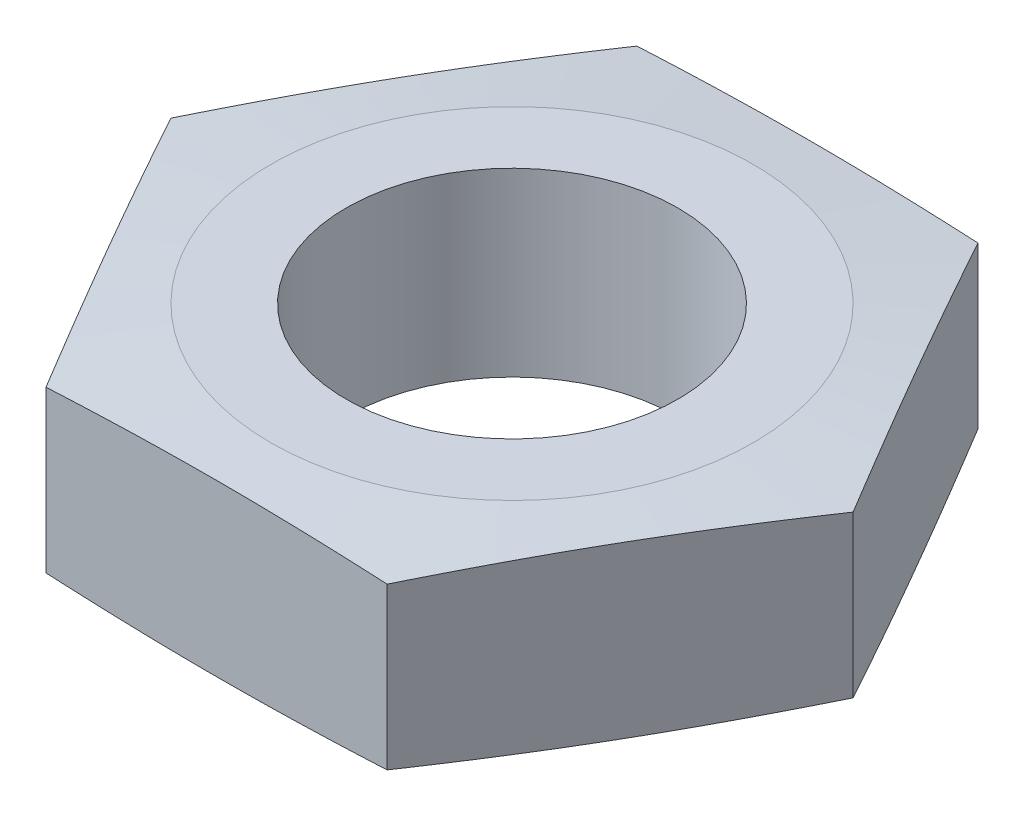
ISO-10303-21;
HEADER;
FILE_DESCRIPTION(('STEP AP214'),'2;1');
FILE_NAME('part.step','',(''),(''),'','','');
FILE_SCHEMA(('AUTOMOTIVE_DESIGN { 1 0 10303 214 1 1 1 1 }'));
ENDSEC;
DATA;
#1=APPLICATION_CONTEXT('core data for automotive mechanical design processes');
#2=APPLICATION_PROTOCOL_DEFINITION('international standard','automotive_design',2000,#1);
#3=PRODUCT_CONTEXT('',#1,'mechanical');
#4=PRODUCT('Part','Part','',(#3));
#5=PRODUCT_RELATED_PRODUCT_CATEGORY('part','',(#4));
#6=PRODUCT_DEFINITION_FORMATION('','',#4);
#7=PRODUCT_DEFINITION_CONTEXT('part definition',#1,'design');
#8=PRODUCT_DEFINITION('design','',#6,#7);
#9=PRODUCT_DEFINITION_SHAPE('','',#8);
#10=(LENGTH_UNIT() NAMED_UNIT(*) SI_UNIT(.MILLI.,.METRE.));
#11=(NAMED_UNIT(*) PLANE_ANGLE_UNIT() SI_UNIT($,.RADIAN.));
#12=(NAMED_UNIT(*) SI_UNIT($,.STERADIAN.) SOLID_ANGLE_UNIT());
#13=UNCERTAINTY_MEASURE_WITH_UNIT(LENGTH_MEASURE(1.E-05),#10,'distance_accuracy_value','');
#14=(GEOMETRIC_REPRESENTATION_CONTEXT(3) GLOBAL_UNCERTAINTY_ASSIGNED_CONTEXT((#13)) GLOBAL_UNIT_ASSIGNED_CONTEXT((#10,
#11,#12)) REPRESENTATION_CONTEXT('',''));
#15=CARTESIAN_POINT('',(0.,0.,0.));
#16=DIRECTION('',(0.,0.,1.));
#17=DIRECTION('',(1.,0.,0.));
#18=AXIS2_PLACEMENT_3D('',#15,#16,#17);
#19=CARTESIAN_POINT('',(-2.82901631902917,1.5,4.9));
#20=DIRECTION('',(0.,0.,-1.));
#21=DIRECTION('',(-1.,0.,0.));
#22=AXIS2_PLACEMENT_3D('',#19,#20,#21);
#23=PLANE('',#22);
#24=CARTESIAN_POINT('',(-7.47109907735667,-1.00653863304741,4.9));
#25=CARTESIAN_POINT('',(-7.24856236014099,-1.02514412298883,4.9));
#26=CARTESIAN_POINT('',(-7.02600547216599,-1.04350771336726,4.9));
#27=CARTESIAN_POINT('',(-6.58084135956366,-1.0796312885138,4.9));
#28=CARTESIAN_POINT('',(-6.35823413462823,-1.09739126948086,4.9));
#29=CARTESIAN_POINT('',(-5.69026658544264,-1.14959039421229,4.9));
#30=CARTESIAN_POINT('',(-5.24481993569117,-1.18294367654422,4.9));
#31=CARTESIAN_POINT('',(-4.35409507703629,-1.24527219436755,4.9));
#32=CARTESIAN_POINT('',(-3.90881719743005,-1.27425207364141,4.9));
#33=CARTESIAN_POINT('',(-3.01787712788772,-1.32566836961985,4.9));
#34=CARTESIAN_POINT('',(-2.5722149480883,-1.34810495392267,4.9));
#35=CARTESIAN_POINT('',(-1.90310838277142,-1.37473844982548,4.9));
#36=CARTESIAN_POINT('',(-1.67980405540288,-1.38244917287994,4.9));
#37=CARTESIAN_POINT('',(-1.23311960808795,-1.39517553267675,4.9));
#38=CARTESIAN_POINT('',(-1.00973948903471,-1.40019120014511,4.9));
#39=CARTESIAN_POINT('',(-0.562943374380458,-1.40726997751627,4.9));
#40=CARTESIAN_POINT('',(-0.339527381266118,-1.40933324179001,4.9));
#41=CARTESIAN_POINT('',(0.107311956766196,-1.41039167435151,4.9));
#42=CARTESIAN_POINT('',(0.330735301682421,-1.40938684336388,4.9));
#43=CARTESIAN_POINT('',(0.777659835380096,-1.40436501603405,4.9));
#44=CARTESIAN_POINT('',(1.00116100688973,-1.40034650689583,4.9));
#45=CARTESIAN_POINT('',(1.44809643611479,-1.38951062191602,4.9));
#46=CARTESIAN_POINT('',(1.67153069306241,-1.38269321510401,4.9));
#47=CARTESIAN_POINT('',(2.34172762215674,-1.35852085026062,4.9));
#48=CARTESIAN_POINT('',(2.78835626533211,-1.33744613842943,4.9));
#49=CARTESIAN_POINT('',(3.66354970944947,-1.28923839010267,4.9));
#50=CARTESIAN_POINT('',(4.09213031646093,-1.26237792602413,4.9));
#51=CARTESIAN_POINT('',(4.94899907590043,-1.20427282978973,4.9));
#52=CARTESIAN_POINT('',(5.37728722203045,-1.17302810603745,4.9));
#53=CARTESIAN_POINT('',(6.23365739957386,-1.10758374437045,4.9));
#54=CARTESIAN_POINT('',(6.6617394188844,-1.07338395021818,4.9));
#55=CARTESIAN_POINT('',(7.51773771687456,-1.00296419443362,4.9));
#56=CARTESIAN_POINT('',(7.94565399497719,-0.96674422583106,4.9));
#57=CARTESIAN_POINT('',(8.80076818602211,-0.892939677446466,4.9));
#58=CARTESIAN_POINT('',(9.22796626975954,-0.855357067420007,4.9));
#59=CARTESIAN_POINT('',(10.0822727519871,-0.779174551195442,4.9));
#60=CARTESIAN_POINT('',(10.5093811502087,-0.740574641995029,4.9));
#61=CARTESIAN_POINT('',(11.3634348139587,-0.662635675856532,4.9));
#62=CARTESIAN_POINT('',(11.7903800946575,-0.623296784778671,4.9));
#63=CARTESIAN_POINT('',(12.6442150050174,-0.544044031663291,4.9));
#64=CARTESIAN_POINT('',(13.0711046349661,-0.504130172726609,4.9));
#65=CARTESIAN_POINT('',(13.4979750990547,-0.464014861585602,4.9));
#66=B_SPLINE_CURVE_WITH_KNOTS('',3,(#24,#25,#26,#27,#28,#29,#30,#31,#32,#33,#34,#35,#36,#37,#38,
#39,#40,#41,#42,#43,#44,#45,#46,#47,#48,#49,#50,#51,#52,#53,#54,#55,#56,#57,#58,#59,#60,#61,#62,
#63,#64,#65),.UNSPECIFIED.,.F.,.F.,(4,2,2,2,2,2,2,2,2,2,2,2,2,2,2,2,2,2,2,2,4),(0.,
0.669938984867388,1.33988218769278,2.67994787700641,4.01858048683973,5.35717880627859,
6.02747745062249,6.69776845281103,7.36802440652299,8.0382802019385,8.70887267549961,
9.37947256951599,10.7207569059899,12.0089933497948,13.2972567115822,14.5855882268773,
15.8739241876202,17.1604667542172,18.4470131181527,19.7332740949343,21.0195281374242),.UNSPECIFIED.);
#67=CARTESIAN_POINT('',(2.82901631902916,-1.33419673619417,4.9));
#68=VERTEX_POINT('',#67);
#69=CARTESIAN_POINT('',(-2.82901631902917,-1.33419673619417,4.9));
#70=VERTEX_POINT('',#69);
#71=EDGE_CURVE('E62',#68,#70,#66,.F.);
#72=ORIENTED_EDGE('',*,*,#71,.F.);
#73=DIRECTION('',(0.,-1.,0.));
#74=VECTOR('',#73,1.);
#75=CARTESIAN_POINT('',(2.82901631902916,1.5,4.9));
#76=LINE('',#75,#74);
#77=CARTESIAN_POINT('',(2.82901631902916,1.33419673619417,4.9));
#78=VERTEX_POINT('',#77);
#79=EDGE_CURVE('E55',#78,#68,#76,.T.);
#80=ORIENTED_EDGE('',*,*,#79,.F.);
#81=CARTESIAN_POINT('',(-7.47109907735667,1.00653863304741,4.9));
#82=CARTESIAN_POINT('',(-7.24856236014099,1.02514412298883,4.9));
#83=CARTESIAN_POINT('',(-7.02600547216599,1.04350771336726,4.9));
#84=CARTESIAN_POINT('',(-6.58084135956366,1.0796312885138,4.9));
#85=CARTESIAN_POINT('',(-6.35823413462823,1.09739126948086,4.9));
#86=CARTESIAN_POINT('',(-5.69026658544264,1.14959039421229,4.9));
#87=CARTESIAN_POINT('',(-5.24481993569117,1.18294367654422,4.9));
#88=CARTESIAN_POINT('',(-4.35409507703629,1.24527219436755,4.9));
#89=CARTESIAN_POINT('',(-3.90881719743005,1.27425207364141,4.9));
#90=CARTESIAN_POINT('',(-3.01787712788772,1.32566836961985,4.9));
#91=CARTESIAN_POINT('',(-2.5722149480883,1.34810495392267,4.9));
#92=CARTESIAN_POINT('',(-1.90310838277142,1.37473844982548,4.9));
#93=CARTESIAN_POINT('',(-1.67980405540288,1.38244917287994,4.9));
#94=CARTESIAN_POINT('',(-1.23311960808795,1.39517553267675,4.9));
#95=CARTESIAN_POINT('',(-1.00973948903471,1.40019120014511,4.9));
#96=CARTESIAN_POINT('',(-0.562943374380458,1.40726997751627,4.9));
#97=CARTESIAN_POINT('',(-0.339527381266118,1.40933324179001,4.9));
#98=CARTESIAN_POINT('',(0.107311956766196,1.41039167435151,4.9));
#99=CARTESIAN_POINT('',(0.330735301682421,1.40938684336388,4.9));
#100=CARTESIAN_POINT('',(0.777659835380096,1.40436501603405,4.9));
#101=CARTESIAN_POINT('',(1.00116100688973,1.40034650689583,4.9));
#102=CARTESIAN_POINT('',(1.44809643611479,1.38951062191602,4.9));
#103=CARTESIAN_POINT('',(1.67153069306241,1.38269321510401,4.9));
#104=CARTESIAN_POINT('',(2.34172762215674,1.35852085026062,4.9));
#105=CARTESIAN_POINT('',(2.78835626533211,1.33744613842943,4.9));
#106=CARTESIAN_POINT('',(3.66354970944947,1.28923839010267,4.9));
#107=CARTESIAN_POINT('',(4.09213031646093,1.26237792602413,4.9));
#108=CARTESIAN_POINT('',(4.94899907590043,1.20427282978973,4.9));
#109=CARTESIAN_POINT('',(5.37728722203045,1.17302810603745,4.9));
#110=CARTESIAN_POINT('',(6.23365739957386,1.10758374437045,4.9));
#111=CARTESIAN_POINT('',(6.6617394188844,1.07338395021818,4.9));
#112=CARTESIAN_POINT('',(7.51773771687456,1.00296419443362,4.9));
#113=CARTESIAN_POINT('',(7.94565399497719,0.96674422583106,4.9));
#114=CARTESIAN_POINT('',(8.80076818602211,0.892939677446466,4.9));
#115=CARTESIAN_POINT('',(9.22796626975954,0.855357067420007,4.9));
#116=CARTESIAN_POINT('',(10.0822727519871,0.779174551195442,4.9));
#117=CARTESIAN_POINT('',(10.5093811502087,0.740574641995029,4.9));
#118=CARTESIAN_POINT('',(11.3634348139587,0.662635675856532,4.9));
#119=CARTESIAN_POINT('',(11.7903800946575,0.623296784778671,4.9));
#120=CARTESIAN_POINT('',(12.6442150050174,0.544044031663291,4.9));
#121=CARTESIAN_POINT('',(13.0711046349661,0.504130172726609,4.9));
#122=CARTESIAN_POINT('',(13.4979750990547,0.464014861585602,4.9));
#123=B_SPLINE_CURVE_WITH_KNOTS('',3,(#81,#82,#83,#84,#85,#86,#87,#88,#89,#90,#91,#92,#93,#94,
#95,#96,#97,#98,#99,#100,#101,#102,#103,#104,#105,#106,#107,#108,#109,#110,#111,#112,#113,#114,
#115,#116,#117,#118,#119,#120,#121,#122),.UNSPECIFIED.,.F.,.F.,(4,2,2,2,2,2,2,2,2,2,2,2,2,2,2,2,
2,2,2,2,4),(0.,0.669938984867388,1.33988218769278,2.67994787700641,4.01858048683973,
5.35717880627859,6.02747745062249,6.69776845281103,7.36802440652299,8.0382802019385,
8.70887267549961,9.37947256951599,10.7207569059899,12.0089933497948,13.2972567115822,
14.5855882268773,15.8739241876202,17.1604667542172,18.4470131181527,19.7332740949343,
21.0195281374242),.UNSPECIFIED.);
#124=CARTESIAN_POINT('',(-2.82901631902917,1.33419673619417,4.9));
#125=VERTEX_POINT('',#124);
#126=EDGE_CURVE('E127',#125,#78,#123,.T.);
#127=ORIENTED_EDGE('',*,*,#126,.F.);
#128=DIRECTION('',(0.,-1.,0.));
#129=VECTOR('',#128,1.);
#130=CARTESIAN_POINT('',(-2.82901631902917,1.5,4.9));
#131=LINE('',#130,#129);
#132=EDGE_CURVE('E120',#125,#70,#131,.T.);
#133=ORIENTED_EDGE('',*,*,#132,.T.);
#134=EDGE_LOOP('',(#72,#80,#127,#133));
#135=FACE_BOUND('',#134,.T.);
#136=ADVANCED_FACE('F39',(#135),#23,.F.);
#137=CARTESIAN_POINT('',(2.82901631902916,1.5,4.9));
#138=DIRECTION('',(-0.866025403784439,0.,-0.5));
#139=DIRECTION('',(-0.5,0.,0.866025403784439));
#140=AXIS2_PLACEMENT_3D('',#137,#138,#139);
#141=PLANE('',#140);
#142=CARTESIAN_POINT('',(5.65814810811217,-1.33418518883531,-0.000199999999996242));
#143=CARTESIAN_POINT('',(5.54031817177861,-1.3459738480169,0.203887436382334));
#144=CARTESIAN_POINT('',(5.42245803825476,-1.35665356088679,0.408027175832484));
#145=CARTESIAN_POINT('',(5.18667966555825,-1.37539024798846,0.816407296668759));
#146=CARTESIAN_POINT('',(5.06876142359181,-1.38344708057591,1.02064768289384));
#147=CARTESIAN_POINT('',(4.83296724142084,-1.39652706360113,1.4290551865431));
#148=CARTESIAN_POINT('',(4.71509133240421,-1.40155240630638,1.63322224994827));
#149=CARTESIAN_POINT('',(4.479318441363,-1.40828883219344,2.04159287627904));
#150=CARTESIAN_POINT('',(4.36142145995338,-1.41,2.24579643813952));
#151=CARTESIAN_POINT('',(4.12562749713412,-1.41,2.65420356186048));
#152=CARTESIAN_POINT('',(4.00773051572449,-1.40828883219344,2.85840712372096));
#153=CARTESIAN_POINT('',(3.77195762468328,-1.40155240630638,3.26677775005173));
#154=CARTESIAN_POINT('',(3.65408171566665,-1.39652706360113,3.4709448134569));
#155=CARTESIAN_POINT('',(3.41828753349569,-1.38344708057591,3.87935231710616));
#156=CARTESIAN_POINT('',(3.30036929152925,-1.37539024798846,4.08359270333124));
#157=CARTESIAN_POINT('',(3.06459091883273,-1.35665356088679,4.49197282416752));
#158=CARTESIAN_POINT('',(2.94673078530889,-1.3459738480169,4.69611256361767));
#159=CARTESIAN_POINT('',(2.82890084897533,-1.33418518883531,4.9002));
#160=B_SPLINE_CURVE_WITH_KNOTS('',3,(#142,#143,#144,#145,#146,#147,#148,#149,#150,#151,#152,
#153,#154,#155,#156,#157,#158,#159),.UNSPECIFIED.,.F.,.F.,(4,2,2,2,2,2,2,2,4),(0.,
0.707868433880265,1.41577508869476,2.12316919454419,2.83054523742568,3.53792128030717,
4.2453153861566,4.9532220409711,5.66109047485136),.UNSPECIFIED.);
#161=CARTESIAN_POINT('',(5.65803263805833,-1.33419673619417,0.));
#162=VERTEX_POINT('',#161);
#163=EDGE_CURVE('E146',#162,#68,#160,.T.);
#164=ORIENTED_EDGE('',*,*,#163,.F.);
#165=DIRECTION('',(0.,-1.,0.));
#166=VECTOR('',#165,1.);
#167=CARTESIAN_POINT('',(5.65803263805833,1.5,0.));
#168=LINE('',#167,#166);
#169=CARTESIAN_POINT('',(5.65803263805833,1.33419673619417,0.));
#170=VERTEX_POINT('',#169);
#171=EDGE_CURVE('E134',#170,#162,#168,.T.);
#172=ORIENTED_EDGE('',*,*,#171,.F.);
#173=CARTESIAN_POINT('',(2.82890084897533,1.33418518883531,4.9002));
#174=CARTESIAN_POINT('',(2.94673078530889,1.3459738480169,4.69611256361767));
#175=CARTESIAN_POINT('',(3.06459091883273,1.35665356088679,4.49197282416752));
#176=CARTESIAN_POINT('',(3.30036929152925,1.37539024798846,4.08359270333124));
#177=CARTESIAN_POINT('',(3.41828753349569,1.38344708057591,3.87935231710616));
#178=CARTESIAN_POINT('',(3.65408171566665,1.39652706360113,3.4709448134569));
#179=CARTESIAN_POINT('',(3.77195762468328,1.40155240630638,3.26677775005173));
#180=CARTESIAN_POINT('',(4.00773051572449,1.40828883219344,2.85840712372096));
#181=CARTESIAN_POINT('',(4.12562749713412,1.41,2.65420356186048));
#182=CARTESIAN_POINT('',(4.36142145995338,1.41,2.24579643813952));
#183=CARTESIAN_POINT('',(4.47931844136301,1.40828883219344,2.04159287627904));
#184=CARTESIAN_POINT('',(4.71509133240421,1.40155240630638,1.63322224994827));
#185=CARTESIAN_POINT('',(4.83296724142084,1.39652706360113,1.4290551865431));
#186=CARTESIAN_POINT('',(5.06876142359181,1.38344708057591,1.02064768289384));
#187=CARTESIAN_POINT('',(5.18667966555825,1.37539024798846,0.816407296668758));
#188=CARTESIAN_POINT('',(5.42245803825476,1.35665356088679,0.408027175832483));
#189=CARTESIAN_POINT('',(5.54031817177861,1.3459738480169,0.203887436382333));
#190=CARTESIAN_POINT('',(5.65814810811217,1.33418518883531,-0.000199999999997153));
#191=B_SPLINE_CURVE_WITH_KNOTS('',3,(#173,#174,#175,#176,#177,#178,#179,#180,#181,#182,#183,
#184,#185,#186,#187,#188,#189,#190),.UNSPECIFIED.,.F.,.F.,(4,2,2,2,2,2,2,2,4),(0.,
0.707868433880266,1.41577508869476,2.12316919454419,2.83054523742568,3.53792128030717,
4.2453153861566,4.9532220409711,5.66109047485136),.UNSPECIFIED.);
#192=EDGE_CURVE('E147',#78,#170,#191,.T.);
#193=ORIENTED_EDGE('',*,*,#192,.F.);
#194=ORIENTED_EDGE('',*,*,#79,.T.);
#195=EDGE_LOOP('',(#164,#172,#193,#194));
#196=FACE_BOUND('',#195,.T.);
#197=ADVANCED_FACE('F144',(#196),#141,.F.);
#198=CARTESIAN_POINT('',(5.65803263805833,1.5,0.));
#199=DIRECTION('',(-0.866025403784439,0.,0.5));
#200=DIRECTION('',(0.5,0.,0.866025403784439));
#201=AXIS2_PLACEMENT_3D('',#198,#199,#200);
#202=PLANE('',#201);
#203=CARTESIAN_POINT('',(2.82890084897533,-1.33418518883531,-4.9002));
#204=CARTESIAN_POINT('',(2.94673078530889,-1.3459738480169,-4.69611256361767));
#205=CARTESIAN_POINT('',(3.06459091883273,-1.35665356088679,-4.49197282416752));
#206=CARTESIAN_POINT('',(3.30036929152925,-1.37539024798846,-4.08359270333124));
#207=CARTESIAN_POINT('',(3.41828753349569,-1.38344708057591,-3.87935231710616));
#208=CARTESIAN_POINT('',(3.65408171566665,-1.39652706360113,-3.4709448134569));
#209=CARTESIAN_POINT('',(3.77195762468328,-1.40155240630638,-3.26677775005173));
#210=CARTESIAN_POINT('',(4.00773051572449,-1.40828883219344,-2.85840712372096));
#211=CARTESIAN_POINT('',(4.12562749713412,-1.41,-2.65420356186048));
#212=CARTESIAN_POINT('',(4.36142145995338,-1.41,-2.24579643813952));
#213=CARTESIAN_POINT('',(4.47931844136301,-1.40828883219344,-2.04159287627904));
#214=CARTESIAN_POINT('',(4.71509133240421,-1.40155240630638,-1.63322224994827));
#215=CARTESIAN_POINT('',(4.83296724142084,-1.39652706360113,-1.42905518654309));
#216=CARTESIAN_POINT('',(5.06876142359181,-1.38344708057591,-1.02064768289383));
#217=CARTESIAN_POINT('',(5.18667966555825,-1.37539024798846,-0.816407296668754));
#218=CARTESIAN_POINT('',(5.42245803825476,-1.35665356088679,-0.408027175832479));
#219=CARTESIAN_POINT('',(5.54031817177861,-1.3459738480169,-0.203887436382328));
#220=CARTESIAN_POINT('',(5.65814810811217,-1.33418518883531,0.000200000000003215));
#221=B_SPLINE_CURVE_WITH_KNOTS('',3,(#203,#204,#205,#206,#207,#208,#209,#210,#211,#212,#213,
#214,#215,#216,#217,#218,#219,#220),.UNSPECIFIED.,.F.,.F.,(4,2,2,2,2,2,2,2,4),(0.,
0.707868433880266,1.41577508869476,2.12316919454419,2.83054523742568,3.53792128030718,
4.24531538615661,4.9532220409711,5.66109047485137),.UNSPECIFIED.);
#222=CARTESIAN_POINT('',(2.82901631902916,-1.33419673619417,-4.9));
#223=VERTEX_POINT('',#222);
#224=EDGE_CURVE('E158',#223,#162,#221,.T.);
#225=ORIENTED_EDGE('',*,*,#224,.F.);
#226=DIRECTION('',(0.,-1.,0.));
#227=VECTOR('',#226,1.);
#228=CARTESIAN_POINT('',(2.82901631902916,1.5,-4.9));
#229=LINE('',#228,#227);
#230=CARTESIAN_POINT('',(2.82901631902916,1.33419673619417,-4.9));
#231=VERTEX_POINT('',#230);
#232=EDGE_CURVE('E125',#231,#223,#229,.T.);
#233=ORIENTED_EDGE('',*,*,#232,.F.);
#234=CARTESIAN_POINT('',(5.65814810811217,1.33418518883531,0.000200000000003808));
#235=CARTESIAN_POINT('',(5.54031817177861,1.3459738480169,-0.203887436382327));
#236=CARTESIAN_POINT('',(5.42245803825476,1.35665356088679,-0.408027175832478));
#237=CARTESIAN_POINT('',(5.18667966555825,1.37539024798846,-0.816407296668753));
#238=CARTESIAN_POINT('',(5.06876142359181,1.38344708057591,-1.02064768289383));
#239=CARTESIAN_POINT('',(4.83296724142084,1.39652706360113,-1.42905518654309));
#240=CARTESIAN_POINT('',(4.71509133240421,1.40155240630638,-1.63322224994826));
#241=CARTESIAN_POINT('',(4.47931844136301,1.40828883219344,-2.04159287627904));
#242=CARTESIAN_POINT('',(4.36142145995338,1.41,-2.24579643813952));
#243=CARTESIAN_POINT('',(4.12562749713412,1.41,-2.65420356186048));
#244=CARTESIAN_POINT('',(4.00773051572449,1.40828883219344,-2.85840712372096));
#245=CARTESIAN_POINT('',(3.77195762468328,1.40155240630638,-3.26677775005173));
#246=CARTESIAN_POINT('',(3.65408171566665,1.39652706360113,-3.4709448134569));
#247=CARTESIAN_POINT('',(3.41828753349569,1.38344708057591,-3.87935231710616));
#248=CARTESIAN_POINT('',(3.30036929152925,1.37539024798846,-4.08359270333124));
#249=CARTESIAN_POINT('',(3.06459091883273,1.35665356088679,-4.49197282416752));
#250=CARTESIAN_POINT('',(2.94673078530889,1.3459738480169,-4.69611256361767));
#251=CARTESIAN_POINT('',(2.82890084897533,1.33418518883531,-4.9002));
#252=B_SPLINE_CURVE_WITH_KNOTS('',3,(#234,#235,#236,#237,#238,#239,#240,#241,#242,#243,#244,
#245,#246,#247,#248,#249,#250,#251),.UNSPECIFIED.,.F.,.F.,(4,2,2,2,2,2,2,2,4),(0.,
0.707868433880265,1.41577508869476,2.12316919454419,2.83054523742568,3.53792128030718,
4.24531538615661,4.9532220409711,5.66109047485137),.UNSPECIFIED.);
#253=EDGE_CURVE('E222',#170,#231,#252,.T.);
#254=ORIENTED_EDGE('',*,*,#253,.F.);
#255=ORIENTED_EDGE('',*,*,#171,.T.);
#256=EDGE_LOOP('',(#225,#233,#254,#255));
#257=FACE_BOUND('',#256,.T.);
#258=ADVANCED_FACE('F213',(#257),#202,.F.);
#259=CARTESIAN_POINT('',(2.82901631902916,1.5,-4.9));
#260=DIRECTION('',(0.,0.,1.));
#261=DIRECTION('',(1.,0.,0.));
#262=AXIS2_PLACEMENT_3D('',#259,#260,#261);
#263=PLANE('',#262);
#264=CARTESIAN_POINT('',(-7.47107277086338,-1.00654083278789,-4.9));
#265=CARTESIAN_POINT('',(-7.24853714490946,-1.02514621180149,-4.9));
#266=CARTESIAN_POINT('',(-7.02598134826093,-1.0435096917819,-4.9));
#267=CARTESIAN_POINT('',(-6.58081941853175,-1.07963304802484,-4.9));
#268=CARTESIAN_POINT('',(-6.358213285143,-1.09739292048635,-4.9));
#269=CARTESIAN_POINT('',(-5.69024901205752,-1.14959172370627,-4.9));
#270=CARTESIAN_POINT('',(-5.24480454729595,-1.18294479712945,-4.9));
#271=CARTESIAN_POINT('',(-4.35408405302938,-1.24527292196112,-4.9));
#272=CARTESIAN_POINT('',(-3.90880835281549,-1.27425261707341,-4.9));
#273=CARTESIAN_POINT('',(-3.01787264548786,-1.32566859540431,-4.9));
#274=CARTESIAN_POINT('',(-2.5722126485105,-1.34810504621666,-4.9));
#275=CARTESIAN_POINT('',(-1.90310937540869,-1.37473840993395,-4.9));
#276=CARTESIAN_POINT('',(-1.67980615603825,-1.38244910014281,-4.9));
#277=CARTESIAN_POINT('',(-1.23312392535325,-1.39517542255663,-4.9));
#278=CARTESIAN_POINT('',(-1.00974491493181,-1.4001910854869,-4.9));
#279=CARTESIAN_POINT('',(-0.562951017484857,-1.40726988509464,-4.9));
#280=CARTESIAN_POINT('',(-0.339536132945977,-1.40933317613975,-4.9));
#281=CARTESIAN_POINT('',(0.107300988481997,-1.41039169328556,-4.9));
#282=CARTESIAN_POINT('',(0.330723225369342,-1.40938692011092,-4.9));
#283=CARTESIAN_POINT('',(0.77764554295953,-1.40436523562848,-4.9));
#284=CARTESIAN_POINT('',(1.00114560639122,-1.40034681154665,-4.9));
#285=CARTESIAN_POINT('',(1.44807882081598,-1.3895111177824,-4.9));
#286=CARTESIAN_POINT('',(1.67151197104126,-1.38269381713022,-4.9));
#287=CARTESIAN_POINT('',(2.34170558124876,-1.3585217917536,-4.9));
#288=CARTESIAN_POINT('',(2.78833201428591,-1.33744733419746,-4.9));
#289=CARTESIAN_POINT('',(3.66352325713748,-1.28923998222644,-4.9));
#290=CARTESIAN_POINT('',(4.0921038710274,-1.26237962743646,-4.9));
#291=CARTESIAN_POINT('',(4.9489726427726,-1.20427471394331,-4.9));
#292=CARTESIAN_POINT('',(5.37726079432968,-1.17303006364109,-4.9));
#293=CARTESIAN_POINT('',(6.23363098259055,-1.10758582507736,-4.9));
#294=CARTESIAN_POINT('',(6.66171300719073,-1.07338608056823,-4.9));
#295=CARTESIAN_POINT('',(7.51771131470573,-1.00296640876898,-4.9));
#296=CARTESIAN_POINT('',(7.94562759704353,-0.966746474508401,-4.9));
#297=CARTESIAN_POINT('',(8.80074180078879,-0.89294198436109,-4.9));
#298=CARTESIAN_POINT('',(9.22793989299101,-0.855359398227256,-4.9));
#299=CARTESIAN_POINT('',(10.0822463916234,-0.77917692314142,-4.9));
#300=CARTESIAN_POINT('',(10.5093547977852,-0.74057703118704,-4.9));
#301=CARTESIAN_POINT('',(11.3634084745804,-0.662638095254369,-4.9));
#302=CARTESIAN_POINT('',(11.7903537603847,-0.623299217141585,-4.9));
#303=CARTESIAN_POINT('',(12.6441886806365,-0.544046486726358,-4.9));
#304=CARTESIAN_POINT('',(13.0710783153715,-0.50413263752482,-4.9));
#305=CARTESIAN_POINT('',(13.4979487841552,-0.464017335133611,-4.9));
#306=B_SPLINE_CURVE_WITH_KNOTS('',3,(#264,#265,#266,#267,#268,#269,#270,#271,#272,#273,#274,
#275,#276,#277,#278,#279,#280,#281,#282,#283,#284,#285,#286,#287,#288,#289,#290,#291,#292,#293,
#294,#295,#296,#297,#298,#299,#300,#301,#302,#303,#304,#305),.UNSPECIFIED.,.F.,.F.,(4,2,2,2,2,2,
2,2,2,2,2,2,2,2,2,2,2,2,2,2,4),(0.,0.669935694741025,1.33987560740933,2.67993471332562,
4.01856076308814,5.35715252327417,6.02744784242187,6.69773551954352,7.36798814874199,
8.03824061962697,8.70882976512751,9.37942633094186,10.7207040087734,12.0089404520295,
13.2972038138165,14.5855353329576,15.873871297627,17.1604138832166,18.446960266208,
19.7332212546681,21.0194753087295),.UNSPECIFIED.);
#307=CARTESIAN_POINT('',(-2.82901631902917,-1.33419673619417,-4.9));
#308=VERTEX_POINT('',#307);
#309=EDGE_CURVE('E116',#308,#223,#306,.T.);
#310=ORIENTED_EDGE('',*,*,#309,.F.);
#311=DIRECTION('',(0.,-1.,0.));
#312=VECTOR('',#311,1.);
#313=CARTESIAN_POINT('',(-2.82901631902917,1.5,-4.9));
#314=LINE('',#313,#312);
#315=CARTESIAN_POINT('',(-2.82901631902917,1.33419673619417,-4.9));
#316=VERTEX_POINT('',#315);
#317=EDGE_CURVE('E114',#316,#308,#314,.T.);
#318=ORIENTED_EDGE('',*,*,#317,.F.);
#319=CARTESIAN_POINT('',(-7.47107277086338,1.00654083278789,-4.9));
#320=CARTESIAN_POINT('',(-7.24853714490946,1.02514621180149,-4.9));
#321=CARTESIAN_POINT('',(-7.02598134826093,1.0435096917819,-4.9));
#322=CARTESIAN_POINT('',(-6.58081941853175,1.07963304802484,-4.9));
#323=CARTESIAN_POINT('',(-6.358213285143,1.09739292048635,-4.9));
#324=CARTESIAN_POINT('',(-5.69024901205752,1.14959172370627,-4.9));
#325=CARTESIAN_POINT('',(-5.24480454729595,1.18294479712945,-4.9));
#326=CARTESIAN_POINT('',(-4.35408405302938,1.24527292196112,-4.9));
#327=CARTESIAN_POINT('',(-3.90880835281549,1.27425261707341,-4.9));
#328=CARTESIAN_POINT('',(-3.01787264548786,1.32566859540431,-4.9));
#329=CARTESIAN_POINT('',(-2.5722126485105,1.34810504621666,-4.9));
#330=CARTESIAN_POINT('',(-1.90310937540869,1.37473840993395,-4.9));
#331=CARTESIAN_POINT('',(-1.67980615603825,1.38244910014281,-4.9));
#332=CARTESIAN_POINT('',(-1.23312392535325,1.39517542255663,-4.9));
#333=CARTESIAN_POINT('',(-1.00974491493181,1.4001910854869,-4.9));
#334=CARTESIAN_POINT('',(-0.562951017484857,1.40726988509464,-4.9));
#335=CARTESIAN_POINT('',(-0.339536132945977,1.40933317613975,-4.9));
#336=CARTESIAN_POINT('',(0.107300988481997,1.41039169328556,-4.9));
#337=CARTESIAN_POINT('',(0.330723225369342,1.40938692011092,-4.9));
#338=CARTESIAN_POINT('',(0.77764554295953,1.40436523562848,-4.9));
#339=CARTESIAN_POINT('',(1.00114560639122,1.40034681154665,-4.9));
#340=CARTESIAN_POINT('',(1.44807882081598,1.3895111177824,-4.9));
#341=CARTESIAN_POINT('',(1.67151197104126,1.38269381713022,-4.9));
#342=CARTESIAN_POINT('',(2.34170558124876,1.3585217917536,-4.9));
#343=CARTESIAN_POINT('',(2.78833201428591,1.33744733419746,-4.9));
#344=CARTESIAN_POINT('',(3.66352325713748,1.28923998222644,-4.9));
#345=CARTESIAN_POINT('',(4.0921038710274,1.26237962743646,-4.9));
#346=CARTESIAN_POINT('',(4.9489726427726,1.20427471394331,-4.9));
#347=CARTESIAN_POINT('',(5.37726079432968,1.17303006364109,-4.9));
#348=CARTESIAN_POINT('',(6.23363098259055,1.10758582507736,-4.9));
#349=CARTESIAN_POINT('',(6.66171300719073,1.07338608056823,-4.9));
#350=CARTESIAN_POINT('',(7.51771131470573,1.00296640876898,-4.9));
#351=CARTESIAN_POINT('',(7.94562759704353,0.966746474508401,-4.9));
#352=CARTESIAN_POINT('',(8.80074180078879,0.89294198436109,-4.9));
#353=CARTESIAN_POINT('',(9.22793989299101,0.855359398227256,-4.9));
#354=CARTESIAN_POINT('',(10.0822463916234,0.77917692314142,-4.9));
#355=CARTESIAN_POINT('',(10.5093547977852,0.74057703118704,-4.9));
#356=CARTESIAN_POINT('',(11.3634084745804,0.662638095254369,-4.9));
#357=CARTESIAN_POINT('',(11.7903537603847,0.623299217141585,-4.9));
#358=CARTESIAN_POINT('',(12.6441886806365,0.544046486726358,-4.9));
#359=CARTESIAN_POINT('',(13.0710783153715,0.50413263752482,-4.9));
#360=CARTESIAN_POINT('',(13.4979487841552,0.464017335133611,-4.9));
#361=B_SPLINE_CURVE_WITH_KNOTS('',3,(#319,#320,#321,#322,#323,#324,#325,#326,#327,#328,#329,
#330,#331,#332,#333,#334,#335,#336,#337,#338,#339,#340,#341,#342,#343,#344,#345,#346,#347,#348,
#349,#350,#351,#352,#353,#354,#355,#356,#357,#358,#359,#360),.UNSPECIFIED.,.F.,.F.,(4,2,2,2,2,2,
2,2,2,2,2,2,2,2,2,2,2,2,2,2,4),(0.,0.669935694741025,1.33987560740933,2.67993471332562,
4.01856076308814,5.35715252327417,6.02744784242187,6.69773551954352,7.36798814874199,
8.03824061962697,8.70882976512751,9.37942633094186,10.7207040087734,12.0089404520295,
13.2972038138165,14.5855353329576,15.873871297627,17.1604138832166,18.446960266208,
19.7332212546681,21.0194753087295),.UNSPECIFIED.);
#362=EDGE_CURVE('E231',#231,#316,#361,.F.);
#363=ORIENTED_EDGE('',*,*,#362,.F.);
#364=ORIENTED_EDGE('',*,*,#232,.T.);
#365=EDGE_LOOP('',(#310,#318,#363,#364));
#366=FACE_BOUND('',#365,.T.);
#367=ADVANCED_FACE('F216',(#366),#263,.F.);
#368=CARTESIAN_POINT('',(-2.82901631902917,1.5,-4.9));
#369=DIRECTION('',(0.866025403784439,0.,0.5));
#370=DIRECTION('',(0.5,0.,-0.866025403784439));
#371=AXIS2_PLACEMENT_3D('',#368,#369,#370);
#372=PLANE('',#371);
#373=CARTESIAN_POINT('',(-5.65814810811218,-1.33418518883531,0.000200000000003685));
#374=CARTESIAN_POINT('',(-5.54031817177862,-1.3459738480169,-0.203887436382326));
#375=CARTESIAN_POINT('',(-5.42245803825477,-1.35665356088679,-0.408027175832477));
#376=CARTESIAN_POINT('',(-5.18667966555826,-1.37539024798846,-0.816407296668753));
#377=CARTESIAN_POINT('',(-5.06876142359181,-1.38344708057591,-1.02064768289383));
#378=CARTESIAN_POINT('',(-4.83296724142085,-1.39652706360113,-1.42905518654309));
#379=CARTESIAN_POINT('',(-4.71509133240422,-1.40155240630638,-1.63322224994826));
#380=CARTESIAN_POINT('',(-4.47931844136301,-1.40828883219344,-2.04159287627903));
#381=CARTESIAN_POINT('',(-4.36142145995338,-1.41,-2.24579643813952));
#382=CARTESIAN_POINT('',(-4.12562749713413,-1.41,-2.65420356186048));
#383=CARTESIAN_POINT('',(-4.0077305157245,-1.40828883219344,-2.85840712372096));
#384=CARTESIAN_POINT('',(-3.77195762468329,-1.40155240630638,-3.26677775005173));
#385=CARTESIAN_POINT('',(-3.65408171566666,-1.39652706360113,-3.4709448134569));
#386=CARTESIAN_POINT('',(-3.41828753349569,-1.38344708057591,-3.87935231710616));
#387=CARTESIAN_POINT('',(-3.30036929152925,-1.37539024798846,-4.08359270333124));
#388=CARTESIAN_POINT('',(-3.06459091883274,-1.35665356088679,-4.49197282416752));
#389=CARTESIAN_POINT('',(-2.94673078530889,-1.3459738480169,-4.69611256361767));
#390=CARTESIAN_POINT('',(-2.82890084897533,-1.33418518883531,-4.9002));
#391=B_SPLINE_CURVE_WITH_KNOTS('',3,(#373,#374,#375,#376,#377,#378,#379,#380,#381,#382,#383,
#384,#385,#386,#387,#388,#389,#390),.UNSPECIFIED.,.F.,.F.,(4,2,2,2,2,2,2,2,4),(0.,
0.707868433880266,1.41577508869476,2.12316919454419,2.83054523742568,3.53792128030718,
4.24531538615661,4.9532220409711,5.66109047485137),.UNSPECIFIED.);
#392=CARTESIAN_POINT('',(-5.65803263805834,-1.33419673619417,0.));
#393=VERTEX_POINT('',#392);
#394=EDGE_CURVE('E99',#393,#308,#391,.T.);
#395=ORIENTED_EDGE('',*,*,#394,.F.);
#396=DIRECTION('',(0.,-1.,0.));
#397=VECTOR('',#396,1.);
#398=CARTESIAN_POINT('',(-5.65803263805834,1.5,0.));
#399=LINE('',#398,#397);
#400=CARTESIAN_POINT('',(-5.65803263805834,1.33419673619417,0.));
#401=VERTEX_POINT('',#400);
#402=EDGE_CURVE('E112',#401,#393,#399,.T.);
#403=ORIENTED_EDGE('',*,*,#402,.F.);
#404=CARTESIAN_POINT('',(-2.82890084897533,1.33418518883531,-4.9002));
#405=CARTESIAN_POINT('',(-2.94673078530889,1.3459738480169,-4.69611256361767));
#406=CARTESIAN_POINT('',(-3.06459091883274,1.35665356088679,-4.49197282416752));
#407=CARTESIAN_POINT('',(-3.30036929152925,1.37539024798846,-4.08359270333124));
#408=CARTESIAN_POINT('',(-3.4182875334957,1.38344708057591,-3.87935231710616));
#409=CARTESIAN_POINT('',(-3.65408171566666,1.39652706360113,-3.4709448134569));
#410=CARTESIAN_POINT('',(-3.77195762468329,1.40155240630638,-3.26677775005173));
#411=CARTESIAN_POINT('',(-4.0077305157245,1.40828883219344,-2.85840712372096));
#412=CARTESIAN_POINT('',(-4.12562749713413,1.41,-2.65420356186048));
#413=CARTESIAN_POINT('',(-4.36142145995338,1.41,-2.24579643813952));
#414=CARTESIAN_POINT('',(-4.47931844136301,1.40828883219344,-2.04159287627903));
#415=CARTESIAN_POINT('',(-4.71509133240422,1.40155240630638,-1.63322224994826));
#416=CARTESIAN_POINT('',(-4.83296724142085,1.39652706360113,-1.42905518654309));
#417=CARTESIAN_POINT('',(-5.06876142359181,1.38344708057591,-1.02064768289383));
#418=CARTESIAN_POINT('',(-5.18667966555826,1.37539024798846,-0.816407296668753));
#419=CARTESIAN_POINT('',(-5.42245803825477,1.35665356088679,-0.408027175832477));
#420=CARTESIAN_POINT('',(-5.54031817177862,1.3459738480169,-0.203887436382326));
#421=CARTESIAN_POINT('',(-5.65814810811218,1.33418518883531,0.000200000000004734));
#422=B_SPLINE_CURVE_WITH_KNOTS('',3,(#404,#405,#406,#407,#408,#409,#410,#411,#412,#413,#414,
#415,#416,#417,#418,#419,#420,#421),.UNSPECIFIED.,.F.,.F.,(4,2,2,2,2,2,2,2,4),(0.,
0.707868433880266,1.41577508869476,2.12316919454419,2.83054523742568,3.53792128030718,
4.24531538615661,4.9532220409711,5.66109047485137),.UNSPECIFIED.);
#423=EDGE_CURVE('E69',#316,#401,#422,.T.);
#424=ORIENTED_EDGE('',*,*,#423,.F.);
#425=ORIENTED_EDGE('',*,*,#317,.T.);
#426=EDGE_LOOP('',(#395,#403,#424,#425));
#427=FACE_BOUND('',#426,.T.);
#428=ADVANCED_FACE('F111',(#427),#372,.F.);
#429=CARTESIAN_POINT('',(-5.65803263805834,1.5,0.));
#430=DIRECTION('',(0.866025403784439,0.,-0.5));
#431=DIRECTION('',(-0.5,0.,-0.866025403784439));
#432=AXIS2_PLACEMENT_3D('',#429,#430,#431);
#433=PLANE('',#432);
#434=CARTESIAN_POINT('',(-2.82890084897533,-1.33418518883531,4.9002));
#435=CARTESIAN_POINT('',(-2.9467307853089,-1.3459738480169,4.69611256361767));
#436=CARTESIAN_POINT('',(-3.06459091883274,-1.35665356088679,4.49197282416752));
#437=CARTESIAN_POINT('',(-3.30036929152926,-1.37539024798846,4.08359270333125));
#438=CARTESIAN_POINT('',(-3.4182875334957,-1.38344708057591,3.87935231710617));
#439=CARTESIAN_POINT('',(-3.65408171566666,-1.39652706360113,3.47094481345691));
#440=CARTESIAN_POINT('',(-3.77195762468329,-1.40155240630638,3.26677775005173));
#441=CARTESIAN_POINT('',(-4.0077305157245,-1.40828883219344,2.85840712372097));
#442=CARTESIAN_POINT('',(-4.12562749713413,-1.41,2.65420356186049));
#443=CARTESIAN_POINT('',(-4.36142145995339,-1.41,2.24579643813952));
#444=CARTESIAN_POINT('',(-4.47931844136301,-1.40828883219344,2.04159287627904));
#445=CARTESIAN_POINT('',(-4.71509133240422,-1.40155240630638,1.63322224994827));
#446=CARTESIAN_POINT('',(-4.83296724142085,-1.39652706360113,1.4290551865431));
#447=CARTESIAN_POINT('',(-5.06876142359182,-1.38344708057591,1.02064768289384));
#448=CARTESIAN_POINT('',(-5.18667966555826,-1.37539024798846,0.816407296668765));
#449=CARTESIAN_POINT('',(-5.42245803825477,-1.35665356088679,0.408027175832489));
#450=CARTESIAN_POINT('',(-5.54031817177861,-1.3459738480169,0.203887436382338));
#451=CARTESIAN_POINT('',(-5.65814810811217,-1.33418518883531,-0.00019999999999537));
#452=B_SPLINE_CURVE_WITH_KNOTS('',3,(#434,#435,#436,#437,#438,#439,#440,#441,#442,#443,#444,
#445,#446,#447,#448,#449,#450,#451),.UNSPECIFIED.,.F.,.F.,(4,2,2,2,2,2,2,2,4),(0.,
0.707868433880264,1.41577508869476,2.12316919454419,2.83054523742568,3.53792128030717,
4.2453153861566,4.95322204097109,5.66109047485136),.UNSPECIFIED.);
#453=EDGE_CURVE('E96',#70,#393,#452,.T.);
#454=ORIENTED_EDGE('',*,*,#453,.F.);
#455=ORIENTED_EDGE('',*,*,#132,.F.);
#456=CARTESIAN_POINT('',(-5.65814810811218,1.33418518883531,-0.000199999999996584));
#457=CARTESIAN_POINT('',(-5.54031817177862,1.3459738480169,0.203887436382334));
#458=CARTESIAN_POINT('',(-5.42245803825478,1.35665356088679,0.408027175832485));
#459=CARTESIAN_POINT('',(-5.18667966555826,1.37539024798846,0.81640729666876));
#460=CARTESIAN_POINT('',(-5.06876142359182,1.38344708057591,1.02064768289384));
#461=CARTESIAN_POINT('',(-4.83296724142085,1.39652706360113,1.4290551865431));
#462=CARTESIAN_POINT('',(-4.71509133240422,1.40155240630638,1.63322224994827));
#463=CARTESIAN_POINT('',(-4.47931844136302,1.40828883219344,2.04159287627904));
#464=CARTESIAN_POINT('',(-4.36142145995339,1.41,2.24579643813952));
#465=CARTESIAN_POINT('',(-4.12562749713413,1.41,2.65420356186048));
#466=CARTESIAN_POINT('',(-4.0077305157245,1.40828883219344,2.85840712372096));
#467=CARTESIAN_POINT('',(-3.77195762468329,1.40155240630638,3.26677775005173));
#468=CARTESIAN_POINT('',(-3.65408171566666,1.39652706360113,3.47094481345691));
#469=CARTESIAN_POINT('',(-3.4182875334957,1.38344708057591,3.87935231710617));
#470=CARTESIAN_POINT('',(-3.30036929152926,1.37539024798846,4.08359270333124));
#471=CARTESIAN_POINT('',(-3.06459091883274,1.35665356088679,4.49197282416752));
#472=CARTESIAN_POINT('',(-2.9467307853089,1.3459738480169,4.69611256361767));
#473=CARTESIAN_POINT('',(-2.82890084897533,1.33418518883531,4.9002));
#474=B_SPLINE_CURVE_WITH_KNOTS('',3,(#456,#457,#458,#459,#460,#461,#462,#463,#464,#465,#466,
#467,#468,#469,#470,#471,#472,#473),.UNSPECIFIED.,.F.,.F.,(4,2,2,2,2,2,2,2,4),(0.,
0.707868433880265,1.41577508869476,2.12316919454419,2.83054523742568,3.53792128030717,
4.2453153861566,4.9532220409711,5.66109047485136),.UNSPECIFIED.);
#475=EDGE_CURVE('E12',#401,#125,#474,.T.);
#476=ORIENTED_EDGE('',*,*,#475,.F.);
#477=ORIENTED_EDGE('',*,*,#402,.T.);
#478=EDGE_LOOP('',(#454,#455,#476,#477));
#479=FACE_BOUND('',#478,.T.);
#480=ADVANCED_FACE('F118',(#479),#433,.F.);
#481=CARTESIAN_POINT('',(0.,-1.5,0.));
#482=DIRECTION('',(0.,1.,0.));
#483=DIRECTION('',(0.,0.,1.));
#484=AXIS2_PLACEMENT_3D('',#481,#482,#483);
#485=PLANE('',#484);
#486=CARTESIAN_POINT('',(0.,-1.5,0.));
#487=DIRECTION('',(0.,-1.,0.));
#488=DIRECTION('',(0.,0.,-1.));
#489=AXIS2_PLACEMENT_3D('',#486,#487,#488);
#490=CIRCLE('',#489,2.74999999999999);
#491=CARTESIAN_POINT('',(0.,-1.5,-2.74999999999999));
#492=VERTEX_POINT('',#491);
#493=EDGE_CURVE('E361',#492,#492,#490,.T.);
#494=ORIENTED_EDGE('',*,*,#493,.F.);
#495=EDGE_LOOP('',(#494));
#496=FACE_BOUND('',#495,.T.);
#497=CARTESIAN_POINT('',(0.,-1.5,0.));
#498=DIRECTION('',(0.,1.,0.));
#499=DIRECTION('',(0.,0.,1.));
#500=AXIS2_PLACEMENT_3D('',#497,#498,#499);
#501=CIRCLE('',#500,4.);
#502=CARTESIAN_POINT('',(0.,-1.5,4.));
#503=VERTEX_POINT('',#502);
#504=EDGE_CURVE('E106',#503,#503,#501,.T.);
#505=ORIENTED_EDGE('',*,*,#504,.F.);
#506=EDGE_LOOP('',(#505));
#507=FACE_BOUND('',#506,.T.);
#508=ADVANCED_FACE('F259',(#496,#507),#485,.F.);
#509=CARTESIAN_POINT('',(0.,1.5,0.));
#510=DIRECTION('',(0.,1.,0.));
#511=DIRECTION('',(0.,0.,1.));
#512=AXIS2_PLACEMENT_3D('',#509,#510,#511);
#513=PLANE('',#512);
#514=CARTESIAN_POINT('',(0.,1.5,0.));
#515=DIRECTION('',(0.,-1.,0.));
#516=DIRECTION('',(0.,0.,-1.));
#517=AXIS2_PLACEMENT_3D('',#514,#515,#516);
#518=CIRCLE('',#517,2.74999999999999);
#519=CARTESIAN_POINT('',(0.,1.5,-2.74999999999999));
#520=VERTEX_POINT('',#519);
#521=EDGE_CURVE('E358',#520,#520,#518,.T.);
#522=ORIENTED_EDGE('',*,*,#521,.T.);
#523=EDGE_LOOP('',(#522));
#524=FACE_BOUND('',#523,.T.);
#525=CARTESIAN_POINT('',(0.,1.5,0.));
#526=DIRECTION('',(0.,1.,0.));
#527=DIRECTION('',(0.,0.,1.));
#528=AXIS2_PLACEMENT_3D('',#525,#526,#527);
#529=CIRCLE('',#528,4.);
#530=CARTESIAN_POINT('',(0.,1.5,4.));
#531=VERTEX_POINT('',#530);
#532=EDGE_CURVE('E151',#531,#531,#529,.T.);
#533=ORIENTED_EDGE('',*,*,#532,.T.);
#534=EDGE_LOOP('',(#533));
#535=FACE_BOUND('',#534,.T.);
#536=ADVANCED_FACE('F262',(#524,#535),#513,.T.);
#537=CARTESIAN_POINT('',(0.,1.5,0.));
#538=DIRECTION('',(0.,-1.,0.));
#539=DIRECTION('',(0.,0.,-1.));
#540=AXIS2_PLACEMENT_3D('',#537,#538,#539);
#541=CONICAL_SURFACE('',#540,4.,1.47112767430373);
#542=ORIENTED_EDGE('',*,*,#532,.F.);
#543=EDGE_LOOP('',(#542));
#544=FACE_BOUND('',#543,.T.);
#545=ORIENTED_EDGE('',*,*,#126,.T.);
#546=ORIENTED_EDGE('',*,*,#192,.T.);
#547=ORIENTED_EDGE('',*,*,#253,.T.);
#548=ORIENTED_EDGE('',*,*,#362,.T.);
#549=ORIENTED_EDGE('',*,*,#423,.T.);
#550=ORIENTED_EDGE('',*,*,#475,.T.);
#551=EDGE_LOOP('',(#545,#546,#547,#548,#549,#550));
#552=FACE_BOUND('',#551,.T.);
#553=ADVANCED_FACE('F176',(#544,#552),#541,.T.);
#554=CARTESIAN_POINT('',(0.,-1.5,0.));
#555=DIRECTION('',(0.,1.,0.));
#556=DIRECTION('',(0.,0.,-1.));
#557=AXIS2_PLACEMENT_3D('',#554,#555,#556);
#558=CONICAL_SURFACE('',#557,4.,1.47112767430373);
#559=ORIENTED_EDGE('',*,*,#504,.T.);
#560=EDGE_LOOP('',(#559));
#561=FACE_BOUND('',#560,.T.);
#562=ORIENTED_EDGE('',*,*,#71,.T.);
#563=ORIENTED_EDGE('',*,*,#453,.T.);
#564=ORIENTED_EDGE('',*,*,#394,.T.);
#565=ORIENTED_EDGE('',*,*,#309,.T.);
#566=ORIENTED_EDGE('',*,*,#224,.T.);
#567=ORIENTED_EDGE('',*,*,#163,.T.);
#568=EDGE_LOOP('',(#562,#563,#564,#565,#566,#567));
#569=FACE_BOUND('',#568,.T.);
#570=ADVANCED_FACE('F98',(#561,#569),#558,.T.);
#571=CARTESIAN_POINT('',(0.,-1.5,0.));
#572=DIRECTION('',(0.,-1.,0.));
#573=DIRECTION('',(0.,0.,-1.));
#574=AXIS2_PLACEMENT_3D('',#571,#572,#573);
#575=CYLINDRICAL_SURFACE('',#574,2.74999999999999);
#576=ORIENTED_EDGE('',*,*,#521,.F.);
#577=EDGE_LOOP('',(#576));
#578=FACE_BOUND('',#577,.T.);
#579=ORIENTED_EDGE('',*,*,#493,.T.);
#580=EDGE_LOOP('',(#579));
#581=FACE_BOUND('',#580,.T.);
#582=ADVANCED_FACE('F175',(#578,#581),#575,.F.);
#583=CLOSED_SHELL('',(#136,#197,#258,#367,#428,#480,#508,#536,#553,#570,#582));
#584=MANIFOLD_SOLID_BREP('B2',#583);
#585=ADVANCED_BREP_SHAPE_REPRESENTATION('',(#18,#584),#14);
#586=SHAPE_DEFINITION_REPRESENTATION(#9,#585);
ENDSEC;
END-ISO-10303-21;
